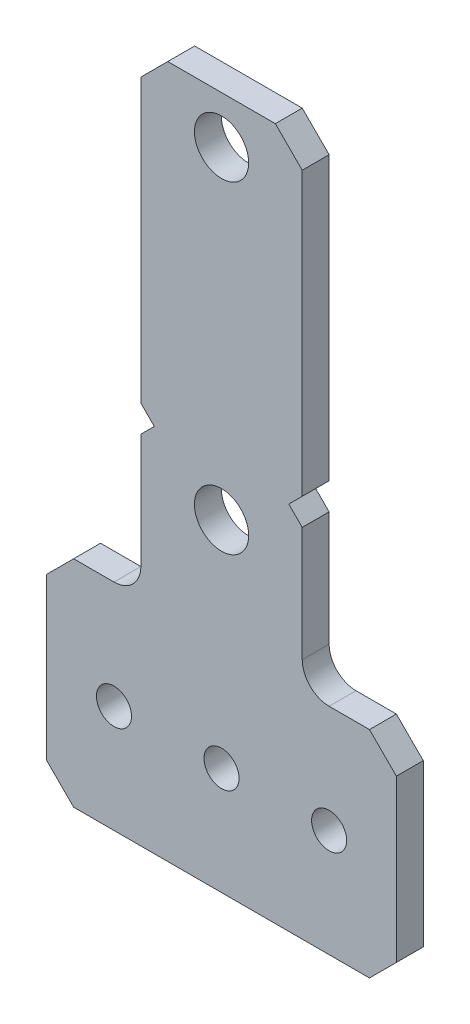
ISO-10303-21;
HEADER;
FILE_DESCRIPTION(('STEP AP214'),'2;1');
FILE_NAME('part.step','',(''),(''),'','','');
FILE_SCHEMA(('AUTOMOTIVE_DESIGN { 1 0 10303 214 1 1 1 1 }'));
ENDSEC;
DATA;
#1=APPLICATION_CONTEXT('core data for automotive mechanical design processes');
#2=APPLICATION_PROTOCOL_DEFINITION('international standard','automotive_design',2000,#1);
#3=PRODUCT_CONTEXT('',#1,'mechanical');
#4=PRODUCT('Part','Part','',(#3));
#5=PRODUCT_RELATED_PRODUCT_CATEGORY('part','',(#4));
#6=PRODUCT_DEFINITION_FORMATION('','',#4);
#7=PRODUCT_DEFINITION_CONTEXT('part definition',#1,'design');
#8=PRODUCT_DEFINITION('design','',#6,#7);
#9=PRODUCT_DEFINITION_SHAPE('','',#8);
#10=(LENGTH_UNIT() NAMED_UNIT(*) SI_UNIT(.MILLI.,.METRE.));
#11=(NAMED_UNIT(*) PLANE_ANGLE_UNIT() SI_UNIT($,.RADIAN.));
#12=(NAMED_UNIT(*) SI_UNIT($,.STERADIAN.) SOLID_ANGLE_UNIT());
#13=UNCERTAINTY_MEASURE_WITH_UNIT(LENGTH_MEASURE(1.E-05),#10,'distance_accuracy_value','');
#14=(GEOMETRIC_REPRESENTATION_CONTEXT(3) GLOBAL_UNCERTAINTY_ASSIGNED_CONTEXT((#13)) GLOBAL_UNIT_ASSIGNED_CONTEXT((#10,
#11,#12)) REPRESENTATION_CONTEXT('',''));
#15=CARTESIAN_POINT('',(0.,0.,0.));
#16=DIRECTION('',(0.,0.,1.));
#17=DIRECTION('',(1.,0.,0.));
#18=AXIS2_PLACEMENT_3D('',#15,#16,#17);
#19=CARTESIAN_POINT('',(-20.6375,-40.894,0.));
#20=DIRECTION('',(0.,0.,1.));
#21=DIRECTION('',(1.,0.,0.));
#22=AXIS2_PLACEMENT_3D('',#19,#20,#21);
#23=PLANE('',#22);
#24=DIRECTION('',(0.707106781186548,-0.707106781186548,0.));
#25=VECTOR('',#24,1.);
#26=CARTESIAN_POINT('',(17.4625,-15.494,0.));
#27=LINE('',#26,#25);
#28=CARTESIAN_POINT('',(17.4625,-15.494,0.));
#29=VERTEX_POINT('',#28);
#30=CARTESIAN_POINT('',(20.6375,-18.669,0.));
#31=VERTEX_POINT('',#30);
#32=EDGE_CURVE('E205',#29,#31,#27,.T.);
#33=ORIENTED_EDGE('',*,*,#32,.T.);
#34=DIRECTION('',(0.,1.,0.));
#35=VECTOR('',#34,1.);
#36=CARTESIAN_POINT('',(20.6375,40.894,0.));
#37=LINE('',#36,#35);
#38=CARTESIAN_POINT('',(20.6375,-37.719,0.));
#39=VERTEX_POINT('',#38);
#40=EDGE_CURVE('E222',#31,#39,#37,.F.);
#41=ORIENTED_EDGE('',*,*,#40,.T.);
#42=DIRECTION('',(-0.707106781186548,-0.707106781186547,0.));
#43=VECTOR('',#42,1.);
#44=CARTESIAN_POINT('',(20.6375,-37.719,0.));
#45=LINE('',#44,#43);
#46=CARTESIAN_POINT('',(17.4625,-40.894,0.));
#47=VERTEX_POINT('',#46);
#48=EDGE_CURVE('E216',#39,#47,#45,.T.);
#49=ORIENTED_EDGE('',*,*,#48,.T.);
#50=DIRECTION('',(1.,0.,0.));
#51=VECTOR('',#50,1.);
#52=CARTESIAN_POINT('',(-20.6375,-40.894,0.));
#53=LINE('',#52,#51);
#54=CARTESIAN_POINT('',(-17.4625,-40.894,0.));
#55=VERTEX_POINT('',#54);
#56=EDGE_CURVE('E217',#47,#55,#53,.F.);
#57=ORIENTED_EDGE('',*,*,#56,.T.);
#58=DIRECTION('',(-0.707106781186548,0.707106781186547,0.));
#59=VECTOR('',#58,1.);
#60=CARTESIAN_POINT('',(-17.4625,-40.894,0.));
#61=LINE('',#60,#59);
#62=CARTESIAN_POINT('',(-20.6375,-37.719,0.));
#63=VERTEX_POINT('',#62);
#64=EDGE_CURVE('E244',#55,#63,#61,.T.);
#65=ORIENTED_EDGE('',*,*,#64,.T.);
#66=DIRECTION('',(0.,1.,0.));
#67=VECTOR('',#66,1.);
#68=CARTESIAN_POINT('',(-20.6375,40.894,0.));
#69=LINE('',#68,#67);
#70=CARTESIAN_POINT('',(-20.6375,-18.669,0.));
#71=VERTEX_POINT('',#70);
#72=EDGE_CURVE('E241',#63,#71,#69,.T.);
#73=ORIENTED_EDGE('',*,*,#72,.T.);
#74=DIRECTION('',(0.707106781186547,0.707106781186548,0.));
#75=VECTOR('',#74,1.);
#76=CARTESIAN_POINT('',(-20.6375,-18.669,0.));
#77=LINE('',#76,#75);
#78=CARTESIAN_POINT('',(-17.4625,-15.494,0.));
#79=VERTEX_POINT('',#78);
#80=EDGE_CURVE('E233',#71,#79,#77,.T.);
#81=ORIENTED_EDGE('',*,*,#80,.T.);
#82=DIRECTION('',(1.,0.,0.));
#83=VECTOR('',#82,1.);
#84=CARTESIAN_POINT('',(-9.52499999999999,-15.494,0.));
#85=LINE('',#84,#83);
#86=CARTESIAN_POINT('',(-12.7,-15.494,0.));
#87=VERTEX_POINT('',#86);
#88=EDGE_CURVE('E230',#79,#87,#85,.T.);
#89=ORIENTED_EDGE('',*,*,#88,.T.);
#90=CARTESIAN_POINT('',(-12.7,-12.319,0.));
#91=DIRECTION('',(0.,0.,1.));
#92=DIRECTION('',(1.,0.,0.));
#93=AXIS2_PLACEMENT_3D('',#90,#91,#92);
#94=CIRCLE('',#93,3.175);
#95=CARTESIAN_POINT('',(-9.52499999999999,-12.319,0.));
#96=VERTEX_POINT('',#95);
#97=EDGE_CURVE('E254',#87,#96,#94,.T.);
#98=ORIENTED_EDGE('',*,*,#97,.T.);
#99=DIRECTION('',(0.,1.,0.));
#100=VECTOR('',#99,1.);
#101=CARTESIAN_POINT('',(-9.525,1.2065,0.));
#102=LINE('',#101,#100);
#103=CARTESIAN_POINT('',(-9.525,1.20650000000001,0.));
#104=VERTEX_POINT('',#103);
#105=EDGE_CURVE('E251',#96,#104,#102,.T.);
#106=ORIENTED_EDGE('',*,*,#105,.T.);
#107=DIRECTION('',(0.707106781186547,0.707106781186548,0.));
#108=VECTOR('',#107,1.);
#109=CARTESIAN_POINT('',(-9.525,1.2065,0.));
#110=LINE('',#109,#108);
#111=CARTESIAN_POINT('',(-7.93749999999999,2.794,0.));
#112=VERTEX_POINT('',#111);
#113=EDGE_CURVE('E258',#104,#112,#110,.T.);
#114=ORIENTED_EDGE('',*,*,#113,.T.);
#115=DIRECTION('',(-0.707106781186548,0.707106781186547,0.));
#116=VECTOR('',#115,1.);
#117=CARTESIAN_POINT('',(-7.93749999999999,2.79400000000001,0.));
#118=LINE('',#117,#116);
#119=CARTESIAN_POINT('',(-9.525,4.3815,0.));
#120=VERTEX_POINT('',#119);
#121=EDGE_CURVE('E264',#112,#120,#118,.T.);
#122=ORIENTED_EDGE('',*,*,#121,.T.);
#123=DIRECTION('',(0.,1.,0.));
#124=VECTOR('',#123,1.);
#125=CARTESIAN_POINT('',(-9.525,37.719,0.));
#126=LINE('',#125,#124);
#127=CARTESIAN_POINT('',(-9.525,37.719,0.));
#128=VERTEX_POINT('',#127);
#129=EDGE_CURVE('E269',#120,#128,#126,.T.);
#130=ORIENTED_EDGE('',*,*,#129,.T.);
#131=DIRECTION('',(0.707106781186549,0.707106781186546,0.));
#132=VECTOR('',#131,1.);
#133=CARTESIAN_POINT('',(-6.35,40.894,0.));
#134=LINE('',#133,#132);
#135=CARTESIAN_POINT('',(-6.35,40.894,0.));
#136=VERTEX_POINT('',#135);
#137=EDGE_CURVE('E274',#128,#136,#134,.T.);
#138=ORIENTED_EDGE('',*,*,#137,.T.);
#139=DIRECTION('',(1.,0.,0.));
#140=VECTOR('',#139,1.);
#141=CARTESIAN_POINT('',(-20.6375,40.894,0.));
#142=LINE('',#141,#140);
#143=CARTESIAN_POINT('',(6.34999999999999,40.894,0.));
#144=VERTEX_POINT('',#143);
#145=EDGE_CURVE('E279',#136,#144,#142,.T.);
#146=ORIENTED_EDGE('',*,*,#145,.T.);
#147=DIRECTION('',(0.707106781186548,-0.707106781186547,0.));
#148=VECTOR('',#147,1.);
#149=CARTESIAN_POINT('',(6.34999999999999,40.894,0.));
#150=LINE('',#149,#148);
#151=CARTESIAN_POINT('',(9.52499999999999,37.719,0.));
#152=VERTEX_POINT('',#151);
#153=EDGE_CURVE('E284',#144,#152,#150,.T.);
#154=ORIENTED_EDGE('',*,*,#153,.T.);
#155=DIRECTION('',(0.,-1.,0.));
#156=VECTOR('',#155,1.);
#157=CARTESIAN_POINT('',(9.52499999999999,37.719,0.));
#158=LINE('',#157,#156);
#159=CARTESIAN_POINT('',(9.52499999999999,4.3815,0.));
#160=VERTEX_POINT('',#159);
#161=EDGE_CURVE('E289',#152,#160,#158,.T.);
#162=ORIENTED_EDGE('',*,*,#161,.T.);
#163=DIRECTION('',(-0.707106781186548,-0.707106781186547,0.));
#164=VECTOR('',#163,1.);
#165=CARTESIAN_POINT('',(7.93749999999999,2.794,0.));
#166=LINE('',#165,#164);
#167=CARTESIAN_POINT('',(7.93749999999999,2.794,0.));
#168=VERTEX_POINT('',#167);
#169=EDGE_CURVE('E294',#160,#168,#166,.T.);
#170=ORIENTED_EDGE('',*,*,#169,.T.);
#171=DIRECTION('',(0.707106781186548,-0.707106781186547,0.));
#172=VECTOR('',#171,1.);
#173=CARTESIAN_POINT('',(9.52499999999999,1.2065,0.));
#174=LINE('',#173,#172);
#175=CARTESIAN_POINT('',(9.525,1.2065,0.));
#176=VERTEX_POINT('',#175);
#177=EDGE_CURVE('E299',#168,#176,#174,.T.);
#178=ORIENTED_EDGE('',*,*,#177,.T.);
#179=DIRECTION('',(0.,-1.,0.));
#180=VECTOR('',#179,1.);
#181=CARTESIAN_POINT('',(9.52499999999999,1.2065,0.));
#182=LINE('',#181,#180);
#183=CARTESIAN_POINT('',(9.525,-12.319,0.));
#184=VERTEX_POINT('',#183);
#185=EDGE_CURVE('E164',#176,#184,#182,.T.);
#186=ORIENTED_EDGE('',*,*,#185,.T.);
#187=CARTESIAN_POINT('',(12.7,-12.319,0.));
#188=DIRECTION('',(0.,0.,1.));
#189=DIRECTION('',(1.,0.,0.));
#190=AXIS2_PLACEMENT_3D('',#187,#188,#189);
#191=CIRCLE('',#190,3.175);
#192=CARTESIAN_POINT('',(12.7,-15.494,0.));
#193=VERTEX_POINT('',#192);
#194=EDGE_CURVE('E166',#184,#193,#191,.T.);
#195=ORIENTED_EDGE('',*,*,#194,.T.);
#196=DIRECTION('',(1.,0.,0.));
#197=VECTOR('',#196,1.);
#198=CARTESIAN_POINT('',(9.525,-15.494,0.));
#199=LINE('',#198,#197);
#200=EDGE_CURVE('E169',#193,#29,#199,.T.);
#201=ORIENTED_EDGE('',*,*,#200,.T.);
#202=EDGE_LOOP('',(#33,#41,#49,#57,#65,#73,#81,#89,#98,#106,#114,#122,#130,#138,#146,#154,#162,
#170,#178,#186,#195,#201));
#203=FACE_BOUND('',#202,.T.);
#204=CARTESIAN_POINT('',(0.,35.306,0.));
#205=DIRECTION('',(0.,0.,-1.));
#206=DIRECTION('',(-1.,0.,0.));
#207=AXIS2_PLACEMENT_3D('',#204,#205,#206);
#208=CIRCLE('',#207,3.2004);
#209=CARTESIAN_POINT('',(-3.2004,35.306,0.));
#210=VERTEX_POINT('',#209);
#211=EDGE_CURVE('E224',#210,#210,#208,.F.);
#212=ORIENTED_EDGE('',*,*,#211,.T.);
#213=EDGE_LOOP('',(#212));
#214=FACE_BOUND('',#213,.T.);
#215=CARTESIAN_POINT('',(0.,-2.79399999999999,0.));
#216=DIRECTION('',(0.,0.,-1.));
#217=DIRECTION('',(-1.,0.,0.));
#218=AXIS2_PLACEMENT_3D('',#215,#216,#217);
#219=CIRCLE('',#218,3.2004);
#220=CARTESIAN_POINT('',(-3.20039999999999,-2.79399999999999,0.));
#221=VERTEX_POINT('',#220);
#222=EDGE_CURVE('E335',#221,#221,#219,.F.);
#223=ORIENTED_EDGE('',*,*,#222,.T.);
#224=EDGE_LOOP('',(#223));
#225=FACE_BOUND('',#224,.T.);
#226=CARTESIAN_POINT('',(-12.7,-28.194,0.));
#227=DIRECTION('',(0.,0.,-1.));
#228=DIRECTION('',(-1.,0.,0.));
#229=AXIS2_PLACEMENT_3D('',#226,#227,#228);
#230=CIRCLE('',#229,2.0701);
#231=CARTESIAN_POINT('',(-14.7701,-28.194,0.));
#232=VERTEX_POINT('',#231);
#233=EDGE_CURVE('E338',#232,#232,#230,.F.);
#234=ORIENTED_EDGE('',*,*,#233,.T.);
#235=EDGE_LOOP('',(#234));
#236=FACE_BOUND('',#235,.T.);
#237=CARTESIAN_POINT('',(12.7,-28.194,0.));
#238=DIRECTION('',(0.,0.,-1.));
#239=DIRECTION('',(-1.,0.,0.));
#240=AXIS2_PLACEMENT_3D('',#237,#238,#239);
#241=CIRCLE('',#240,2.0701);
#242=CARTESIAN_POINT('',(10.6299,-28.194,0.));
#243=VERTEX_POINT('',#242);
#244=EDGE_CURVE('E340',#243,#243,#241,.F.);
#245=ORIENTED_EDGE('',*,*,#244,.T.);
#246=EDGE_LOOP('',(#245));
#247=FACE_BOUND('',#246,.T.);
#248=CARTESIAN_POINT('',(0.,-28.194,0.));
#249=DIRECTION('',(0.,0.,-1.));
#250=DIRECTION('',(-1.,0.,0.));
#251=AXIS2_PLACEMENT_3D('',#248,#249,#250);
#252=CIRCLE('',#251,2.0701);
#253=CARTESIAN_POINT('',(-2.07009999999999,-28.194,0.));
#254=VERTEX_POINT('',#253);
#255=EDGE_CURVE('E20',#254,#254,#252,.F.);
#256=ORIENTED_EDGE('',*,*,#255,.T.);
#257=EDGE_LOOP('',(#256));
#258=FACE_BOUND('',#257,.T.);
#259=ADVANCED_FACE('F17',(#203,#214,#225,#236,#247,#258),#23,.F.);
#260=CARTESIAN_POINT('',(0.,-28.194,3.175));
#261=DIRECTION('',(0.,0.,-1.));
#262=DIRECTION('',(-1.,0.,0.));
#263=AXIS2_PLACEMENT_3D('',#260,#261,#262);
#264=CYLINDRICAL_SURFACE('',#263,2.0701);
#265=CARTESIAN_POINT('',(0.,-28.194,3.175));
#266=DIRECTION('',(0.,0.,-1.));
#267=DIRECTION('',(-1.,0.,0.));
#268=AXIS2_PLACEMENT_3D('',#265,#266,#267);
#269=CIRCLE('',#268,2.0701);
#270=CARTESIAN_POINT('',(-2.07009999999999,-28.194,3.175));
#271=VERTEX_POINT('',#270);
#272=EDGE_CURVE('E328',#271,#271,#269,.T.);
#273=ORIENTED_EDGE('',*,*,#272,.F.);
#274=EDGE_LOOP('',(#273));
#275=FACE_BOUND('',#274,.T.);
#276=ORIENTED_EDGE('',*,*,#255,.F.);
#277=EDGE_LOOP('',(#276));
#278=FACE_BOUND('',#277,.T.);
#279=ADVANCED_FACE('F348',(#275,#278),#264,.F.);
#280=CARTESIAN_POINT('',(12.7,-28.194,3.175));
#281=DIRECTION('',(0.,0.,-1.));
#282=DIRECTION('',(-1.,0.,0.));
#283=AXIS2_PLACEMENT_3D('',#280,#281,#282);
#284=CYLINDRICAL_SURFACE('',#283,2.0701);
#285=CARTESIAN_POINT('',(12.7,-28.194,3.175));
#286=DIRECTION('',(0.,0.,-1.));
#287=DIRECTION('',(-1.,0.,0.));
#288=AXIS2_PLACEMENT_3D('',#285,#286,#287);
#289=CIRCLE('',#288,2.0701);
#290=CARTESIAN_POINT('',(10.6299,-28.194,3.175));
#291=VERTEX_POINT('',#290);
#292=EDGE_CURVE('E325',#291,#291,#289,.T.);
#293=ORIENTED_EDGE('',*,*,#292,.F.);
#294=EDGE_LOOP('',(#293));
#295=FACE_BOUND('',#294,.T.);
#296=ORIENTED_EDGE('',*,*,#244,.F.);
#297=EDGE_LOOP('',(#296));
#298=FACE_BOUND('',#297,.T.);
#299=ADVANCED_FACE('F350',(#295,#298),#284,.F.);
#300=CARTESIAN_POINT('',(-12.7,-28.194,3.175));
#301=DIRECTION('',(0.,0.,-1.));
#302=DIRECTION('',(-1.,0.,0.));
#303=AXIS2_PLACEMENT_3D('',#300,#301,#302);
#304=CYLINDRICAL_SURFACE('',#303,2.0701);
#305=CARTESIAN_POINT('',(-12.7,-28.194,3.175));
#306=DIRECTION('',(0.,0.,-1.));
#307=DIRECTION('',(-1.,0.,0.));
#308=AXIS2_PLACEMENT_3D('',#305,#306,#307);
#309=CIRCLE('',#308,2.0701);
#310=CARTESIAN_POINT('',(-14.7701,-28.194,3.175));
#311=VERTEX_POINT('',#310);
#312=EDGE_CURVE('E322',#311,#311,#309,.T.);
#313=ORIENTED_EDGE('',*,*,#312,.F.);
#314=EDGE_LOOP('',(#313));
#315=FACE_BOUND('',#314,.T.);
#316=ORIENTED_EDGE('',*,*,#233,.F.);
#317=EDGE_LOOP('',(#316));
#318=FACE_BOUND('',#317,.T.);
#319=ADVANCED_FACE('F357',(#315,#318),#304,.F.);
#320=CARTESIAN_POINT('',(0.,-2.79399999999999,3.175));
#321=DIRECTION('',(0.,0.,-1.));
#322=DIRECTION('',(-1.,0.,0.));
#323=AXIS2_PLACEMENT_3D('',#320,#321,#322);
#324=CYLINDRICAL_SURFACE('',#323,3.2004);
#325=CARTESIAN_POINT('',(0.,-2.79399999999999,3.175));
#326=DIRECTION('',(0.,0.,-1.));
#327=DIRECTION('',(-1.,0.,0.));
#328=AXIS2_PLACEMENT_3D('',#325,#326,#327);
#329=CIRCLE('',#328,3.2004);
#330=CARTESIAN_POINT('',(-3.20039999999999,-2.79399999999999,3.175));
#331=VERTEX_POINT('',#330);
#332=EDGE_CURVE('E319',#331,#331,#329,.T.);
#333=ORIENTED_EDGE('',*,*,#332,.F.);
#334=EDGE_LOOP('',(#333));
#335=FACE_BOUND('',#334,.T.);
#336=ORIENTED_EDGE('',*,*,#222,.F.);
#337=EDGE_LOOP('',(#336));
#338=FACE_BOUND('',#337,.T.);
#339=ADVANCED_FACE('F456',(#335,#338),#324,.F.);
#340=CARTESIAN_POINT('',(0.,35.306,3.175));
#341=DIRECTION('',(0.,0.,-1.));
#342=DIRECTION('',(-1.,0.,0.));
#343=AXIS2_PLACEMENT_3D('',#340,#341,#342);
#344=CYLINDRICAL_SURFACE('',#343,3.2004);
#345=CARTESIAN_POINT('',(0.,35.306,3.175));
#346=DIRECTION('',(0.,0.,-1.));
#347=DIRECTION('',(-1.,0.,0.));
#348=AXIS2_PLACEMENT_3D('',#345,#346,#347);
#349=CIRCLE('',#348,3.2004);
#350=CARTESIAN_POINT('',(-3.2004,35.306,3.175));
#351=VERTEX_POINT('',#350);
#352=EDGE_CURVE('E210',#351,#351,#349,.T.);
#353=ORIENTED_EDGE('',*,*,#352,.F.);
#354=EDGE_LOOP('',(#353));
#355=FACE_BOUND('',#354,.T.);
#356=ORIENTED_EDGE('',*,*,#211,.F.);
#357=EDGE_LOOP('',(#356));
#358=FACE_BOUND('',#357,.T.);
#359=ADVANCED_FACE('F452',(#355,#358),#344,.F.);
#360=CARTESIAN_POINT('',(20.6375,40.894,3.175));
#361=DIRECTION('',(-1.,0.,0.));
#362=DIRECTION('',(0.,0.,1.));
#363=AXIS2_PLACEMENT_3D('',#360,#361,#362);
#364=PLANE('',#363);
#365=DIRECTION('',(0.,0.,1.));
#366=VECTOR('',#365,1.);
#367=CARTESIAN_POINT('',(20.6375,-18.669,3.175));
#368=LINE('',#367,#366);
#369=CARTESIAN_POINT('',(20.6375,-18.669,3.175));
#370=VERTEX_POINT('',#369);
#371=EDGE_CURVE('E182',#31,#370,#368,.T.);
#372=ORIENTED_EDGE('',*,*,#371,.T.);
#373=DIRECTION('',(0.,1.,0.));
#374=VECTOR('',#373,1.);
#375=CARTESIAN_POINT('',(20.6375,-40.894,3.175));
#376=LINE('',#375,#374);
#377=CARTESIAN_POINT('',(20.6375,-37.719,3.175));
#378=VERTEX_POINT('',#377);
#379=EDGE_CURVE('E201',#378,#370,#376,.T.);
#380=ORIENTED_EDGE('',*,*,#379,.F.);
#381=DIRECTION('',(0.,0.,1.));
#382=VECTOR('',#381,1.);
#383=CARTESIAN_POINT('',(20.6375,-37.719,3.175));
#384=LINE('',#383,#382);
#385=EDGE_CURVE('E213',#378,#39,#384,.F.);
#386=ORIENTED_EDGE('',*,*,#385,.T.);
#387=ORIENTED_EDGE('',*,*,#40,.F.);
#388=EDGE_LOOP('',(#372,#380,#386,#387));
#389=FACE_BOUND('',#388,.T.);
#390=ADVANCED_FACE('F448',(#389),#364,.F.);
#391=CARTESIAN_POINT('',(17.4625,-15.494,3.175));
#392=DIRECTION('',(-0.707106781186548,-0.707106781186548,0.));
#393=DIRECTION('',(0.707106781186548,-0.707106781186548,0.));
#394=AXIS2_PLACEMENT_3D('',#391,#392,#393);
#395=PLANE('',#394);
#396=ORIENTED_EDGE('',*,*,#371,.F.);
#397=ORIENTED_EDGE('',*,*,#32,.F.);
#398=DIRECTION('',(0.,0.,1.));
#399=VECTOR('',#398,1.);
#400=CARTESIAN_POINT('',(17.4625,-15.494,3.175));
#401=LINE('',#400,#399);
#402=CARTESIAN_POINT('',(17.4625,-15.494,3.175));
#403=VERTEX_POINT('',#402);
#404=EDGE_CURVE('E175',#29,#403,#401,.T.);
#405=ORIENTED_EDGE('',*,*,#404,.T.);
#406=DIRECTION('',(-0.707106781186548,0.707106781186547,0.));
#407=VECTOR('',#406,1.);
#408=CARTESIAN_POINT('',(20.6375,-18.669,3.175));
#409=LINE('',#408,#407);
#410=EDGE_CURVE('E197',#370,#403,#409,.T.);
#411=ORIENTED_EDGE('',*,*,#410,.F.);
#412=EDGE_LOOP('',(#396,#397,#405,#411));
#413=FACE_BOUND('',#412,.T.);
#414=ADVANCED_FACE('F445',(#413),#395,.F.);
#415=CARTESIAN_POINT('',(9.525,-15.494,3.175));
#416=DIRECTION('',(0.,-1.,0.));
#417=DIRECTION('',(1.,0.,0.));
#418=AXIS2_PLACEMENT_3D('',#415,#416,#417);
#419=PLANE('',#418);
#420=ORIENTED_EDGE('',*,*,#404,.F.);
#421=ORIENTED_EDGE('',*,*,#200,.F.);
#422=DIRECTION('',(0.,0.,1.));
#423=VECTOR('',#422,1.);
#424=CARTESIAN_POINT('',(12.7,-15.494,3.175));
#425=LINE('',#424,#423);
#426=CARTESIAN_POINT('',(12.7,-15.494,3.175));
#427=VERTEX_POINT('',#426);
#428=EDGE_CURVE('E174',#193,#427,#425,.T.);
#429=ORIENTED_EDGE('',*,*,#428,.T.);
#430=DIRECTION('',(1.,0.,0.));
#431=VECTOR('',#430,1.);
#432=CARTESIAN_POINT('',(-20.6375,-15.494,3.175));
#433=LINE('',#432,#431);
#434=EDGE_CURVE('E200',#403,#427,#433,.F.);
#435=ORIENTED_EDGE('',*,*,#434,.F.);
#436=EDGE_LOOP('',(#420,#421,#429,#435));
#437=FACE_BOUND('',#436,.T.);
#438=ADVANCED_FACE('F179',(#437),#419,.F.);
#439=CARTESIAN_POINT('',(12.7,-12.319,3.175));
#440=DIRECTION('',(0.,0.,1.));
#441=DIRECTION('',(1.,0.,0.));
#442=AXIS2_PLACEMENT_3D('',#439,#440,#441);
#443=CYLINDRICAL_SURFACE('',#442,3.175);
#444=ORIENTED_EDGE('',*,*,#428,.F.);
#445=ORIENTED_EDGE('',*,*,#194,.F.);
#446=DIRECTION('',(0.,0.,1.));
#447=VECTOR('',#446,1.);
#448=CARTESIAN_POINT('',(9.525,-12.319,3.175));
#449=LINE('',#448,#447);
#450=CARTESIAN_POINT('',(9.525,-12.319,3.175));
#451=VERTEX_POINT('',#450);
#452=EDGE_CURVE('E189',#184,#451,#449,.T.);
#453=ORIENTED_EDGE('',*,*,#452,.T.);
#454=CARTESIAN_POINT('',(12.7,-12.319,3.175));
#455=DIRECTION('',(0.,0.,1.));
#456=DIRECTION('',(1.,0.,0.));
#457=AXIS2_PLACEMENT_3D('',#454,#455,#456);
#458=CIRCLE('',#457,3.175);
#459=EDGE_CURVE('E186',#427,#451,#458,.F.);
#460=ORIENTED_EDGE('',*,*,#459,.F.);
#461=EDGE_LOOP('',(#444,#445,#453,#460));
#462=FACE_BOUND('',#461,.T.);
#463=ADVANCED_FACE('F184',(#462),#443,.F.);
#464=CARTESIAN_POINT('',(9.52499999999999,1.2065,3.175));
#465=DIRECTION('',(-1.,0.,0.));
#466=DIRECTION('',(0.,-1.,0.));
#467=AXIS2_PLACEMENT_3D('',#464,#465,#466);
#468=PLANE('',#467);
#469=ORIENTED_EDGE('',*,*,#452,.F.);
#470=ORIENTED_EDGE('',*,*,#185,.F.);
#471=DIRECTION('',(0.,0.,1.));
#472=VECTOR('',#471,1.);
#473=CARTESIAN_POINT('',(9.525,1.2065,3.175));
#474=LINE('',#473,#472);
#475=CARTESIAN_POINT('',(9.52499999999999,1.2065,3.175));
#476=VERTEX_POINT('',#475);
#477=EDGE_CURVE('E296',#176,#476,#474,.T.);
#478=ORIENTED_EDGE('',*,*,#477,.T.);
#479=DIRECTION('',(0.,1.,0.));
#480=VECTOR('',#479,1.);
#481=CARTESIAN_POINT('',(9.525,-40.894,3.175));
#482=LINE('',#481,#480);
#483=EDGE_CURVE('E316',#451,#476,#482,.T.);
#484=ORIENTED_EDGE('',*,*,#483,.F.);
#485=EDGE_LOOP('',(#469,#470,#478,#484));
#486=FACE_BOUND('',#485,.T.);
#487=ADVANCED_FACE('F436',(#486),#468,.F.);
#488=CARTESIAN_POINT('',(9.52499999999999,1.2065,3.175));
#489=DIRECTION('',(-0.707106781186547,-0.707106781186548,0.));
#490=DIRECTION('',(0.707106781186548,-0.707106781186547,0.));
#491=AXIS2_PLACEMENT_3D('',#488,#489,#490);
#492=PLANE('',#491);
#493=DIRECTION('',(-0.707106781186549,0.707106781186546,0.));
#494=VECTOR('',#493,1.);
#495=CARTESIAN_POINT('',(9.525,1.2065,3.175));
#496=LINE('',#495,#494);
#497=CARTESIAN_POINT('',(7.93749999999999,2.794,3.175));
#498=VERTEX_POINT('',#497);
#499=EDGE_CURVE('E747',#476,#498,#496,.T.);
#500=ORIENTED_EDGE('',*,*,#499,.F.);
#501=ORIENTED_EDGE('',*,*,#477,.F.);
#502=ORIENTED_EDGE('',*,*,#177,.F.);
#503=DIRECTION('',(0.,0.,1.));
#504=VECTOR('',#503,1.);
#505=CARTESIAN_POINT('',(7.93749999999999,2.794,3.175));
#506=LINE('',#505,#504);
#507=EDGE_CURVE('E291',#168,#498,#506,.T.);
#508=ORIENTED_EDGE('',*,*,#507,.T.);
#509=EDGE_LOOP('',(#500,#501,#502,#508));
#510=FACE_BOUND('',#509,.T.);
#511=ADVANCED_FACE('F432',(#510),#492,.F.);
#512=CARTESIAN_POINT('',(7.93749999999999,2.794,3.175));
#513=DIRECTION('',(-0.707106781186547,0.707106781186548,0.));
#514=DIRECTION('',(-0.707106781186548,-0.707106781186547,0.));
#515=AXIS2_PLACEMENT_3D('',#512,#513,#514);
#516=PLANE('',#515);
#517=DIRECTION('',(0.707106781186548,0.707106781186548,0.));
#518=VECTOR('',#517,1.);
#519=CARTESIAN_POINT('',(7.93749999999999,2.794,3.175));
#520=LINE('',#519,#518);
#521=CARTESIAN_POINT('',(9.525,4.3815,3.175));
#522=VERTEX_POINT('',#521);
#523=EDGE_CURVE('E739',#498,#522,#520,.T.);
#524=ORIENTED_EDGE('',*,*,#523,.F.);
#525=ORIENTED_EDGE('',*,*,#507,.F.);
#526=ORIENTED_EDGE('',*,*,#169,.F.);
#527=DIRECTION('',(0.,0.,1.));
#528=VECTOR('',#527,1.);
#529=CARTESIAN_POINT('',(9.52499999999999,4.3815,3.175));
#530=LINE('',#529,#528);
#531=EDGE_CURVE('E286',#160,#522,#530,.T.);
#532=ORIENTED_EDGE('',*,*,#531,.T.);
#533=EDGE_LOOP('',(#524,#525,#526,#532));
#534=FACE_BOUND('',#533,.T.);
#535=ADVANCED_FACE('F428',(#534),#516,.F.);
#536=CARTESIAN_POINT('',(9.52499999999999,37.719,3.175));
#537=DIRECTION('',(-1.,0.,0.));
#538=DIRECTION('',(0.,-1.,0.));
#539=AXIS2_PLACEMENT_3D('',#536,#537,#538);
#540=PLANE('',#539);
#541=DIRECTION('',(0.,1.,0.));
#542=VECTOR('',#541,1.);
#543=CARTESIAN_POINT('',(9.525,-40.894,3.175));
#544=LINE('',#543,#542);
#545=CARTESIAN_POINT('',(9.52499999999999,37.719,3.175));
#546=VERTEX_POINT('',#545);
#547=EDGE_CURVE('E731',#522,#546,#544,.T.);
#548=ORIENTED_EDGE('',*,*,#547,.F.);
#549=ORIENTED_EDGE('',*,*,#531,.F.);
#550=ORIENTED_EDGE('',*,*,#161,.F.);
#551=DIRECTION('',(0.,0.,1.));
#552=VECTOR('',#551,1.);
#553=CARTESIAN_POINT('',(9.52499999999999,37.719,3.175));
#554=LINE('',#553,#552);
#555=EDGE_CURVE('E281',#152,#546,#554,.T.);
#556=ORIENTED_EDGE('',*,*,#555,.T.);
#557=EDGE_LOOP('',(#548,#549,#550,#556));
#558=FACE_BOUND('',#557,.T.);
#559=ADVANCED_FACE('F424',(#558),#540,.F.);
#560=CARTESIAN_POINT('',(6.34999999999999,40.894,3.175));
#561=DIRECTION('',(-0.707106781186547,-0.707106781186548,0.));
#562=DIRECTION('',(0.707106781186548,-0.707106781186547,0.));
#563=AXIS2_PLACEMENT_3D('',#560,#561,#562);
#564=PLANE('',#563);
#565=ORIENTED_EDGE('',*,*,#555,.F.);
#566=ORIENTED_EDGE('',*,*,#153,.F.);
#567=DIRECTION('',(0.,0.,-1.));
#568=VECTOR('',#567,1.);
#569=CARTESIAN_POINT('',(6.34999999999998,40.894,3.175));
#570=LINE('',#569,#568);
#571=CARTESIAN_POINT('',(6.34999999999998,40.894,3.175));
#572=VERTEX_POINT('',#571);
#573=EDGE_CURVE('E276',#144,#572,#570,.F.);
#574=ORIENTED_EDGE('',*,*,#573,.T.);
#575=DIRECTION('',(-0.707106781186548,0.707106781186547,0.));
#576=VECTOR('',#575,1.);
#577=CARTESIAN_POINT('',(9.52499999999999,37.719,3.175));
#578=LINE('',#577,#576);
#579=EDGE_CURVE('E723',#546,#572,#578,.T.);
#580=ORIENTED_EDGE('',*,*,#579,.F.);
#581=EDGE_LOOP('',(#565,#566,#574,#580));
#582=FACE_BOUND('',#581,.T.);
#583=ADVANCED_FACE('F420',(#582),#564,.F.);
#584=CARTESIAN_POINT('',(-20.6375,40.894,3.175));
#585=DIRECTION('',(0.,-1.,0.));
#586=DIRECTION('',(0.,0.,-1.));
#587=AXIS2_PLACEMENT_3D('',#584,#585,#586);
#588=PLANE('',#587);
#589=DIRECTION('',(1.,0.,0.));
#590=VECTOR('',#589,1.);
#591=CARTESIAN_POINT('',(-20.6375,40.894,3.175));
#592=LINE('',#591,#590);
#593=CARTESIAN_POINT('',(-6.34999999999999,40.894,3.175));
#594=VERTEX_POINT('',#593);
#595=EDGE_CURVE('E715',#572,#594,#592,.F.);
#596=ORIENTED_EDGE('',*,*,#595,.F.);
#597=ORIENTED_EDGE('',*,*,#573,.F.);
#598=ORIENTED_EDGE('',*,*,#145,.F.);
#599=DIRECTION('',(0.,0.,1.));
#600=VECTOR('',#599,1.);
#601=CARTESIAN_POINT('',(-6.35,40.894,3.175));
#602=LINE('',#601,#600);
#603=EDGE_CURVE('E271',#136,#594,#602,.T.);
#604=ORIENTED_EDGE('',*,*,#603,.T.);
#605=EDGE_LOOP('',(#596,#597,#598,#604));
#606=FACE_BOUND('',#605,.T.);
#607=ADVANCED_FACE('F416',(#606),#588,.F.);
#608=CARTESIAN_POINT('',(-6.35,40.894,3.175));
#609=DIRECTION('',(0.707106781186546,-0.707106781186549,0.));
#610=DIRECTION('',(0.707106781186549,0.707106781186546,0.));
#611=AXIS2_PLACEMENT_3D('',#608,#609,#610);
#612=PLANE('',#611);
#613=DIRECTION('',(-0.707106781186548,-0.707106781186547,0.));
#614=VECTOR('',#613,1.);
#615=CARTESIAN_POINT('',(-6.35,40.894,3.175));
#616=LINE('',#615,#614);
#617=CARTESIAN_POINT('',(-9.525,37.719,3.175));
#618=VERTEX_POINT('',#617);
#619=EDGE_CURVE('E707',#594,#618,#616,.T.);
#620=ORIENTED_EDGE('',*,*,#619,.F.);
#621=ORIENTED_EDGE('',*,*,#603,.F.);
#622=ORIENTED_EDGE('',*,*,#137,.F.);
#623=DIRECTION('',(0.,0.,1.));
#624=VECTOR('',#623,1.);
#625=CARTESIAN_POINT('',(-9.525,37.719,3.175));
#626=LINE('',#625,#624);
#627=EDGE_CURVE('E266',#128,#618,#626,.T.);
#628=ORIENTED_EDGE('',*,*,#627,.T.);
#629=EDGE_LOOP('',(#620,#621,#622,#628));
#630=FACE_BOUND('',#629,.T.);
#631=ADVANCED_FACE('F412',(#630),#612,.F.);
#632=CARTESIAN_POINT('',(-9.525,37.719,3.175));
#633=DIRECTION('',(1.,0.,0.));
#634=DIRECTION('',(0.,1.,0.));
#635=AXIS2_PLACEMENT_3D('',#632,#633,#634);
#636=PLANE('',#635);
#637=DIRECTION('',(0.,1.,0.));
#638=VECTOR('',#637,1.);
#639=CARTESIAN_POINT('',(-9.525,-40.894,3.175));
#640=LINE('',#639,#638);
#641=CARTESIAN_POINT('',(-9.525,4.38150000000002,3.175));
#642=VERTEX_POINT('',#641);
#643=EDGE_CURVE('E699',#618,#642,#640,.F.);
#644=ORIENTED_EDGE('',*,*,#643,.F.);
#645=ORIENTED_EDGE('',*,*,#627,.F.);
#646=ORIENTED_EDGE('',*,*,#129,.F.);
#647=DIRECTION('',(0.,0.,1.));
#648=VECTOR('',#647,1.);
#649=CARTESIAN_POINT('',(-9.525,4.3815,3.175));
#650=LINE('',#649,#648);
#651=EDGE_CURVE('E261',#120,#642,#650,.T.);
#652=ORIENTED_EDGE('',*,*,#651,.T.);
#653=EDGE_LOOP('',(#644,#645,#646,#652));
#654=FACE_BOUND('',#653,.T.);
#655=ADVANCED_FACE('F408',(#654),#636,.F.);
#656=CARTESIAN_POINT('',(-7.93749999999999,2.79400000000001,3.175));
#657=DIRECTION('',(0.707106781186547,0.707106781186548,0.));
#658=DIRECTION('',(-0.707106781186548,0.707106781186547,0.));
#659=AXIS2_PLACEMENT_3D('',#656,#657,#658);
#660=PLANE('',#659);
#661=DIRECTION('',(0.707106781186548,-0.707106781186547,0.));
#662=VECTOR('',#661,1.);
#663=CARTESIAN_POINT('',(-9.525,4.3815,3.175));
#664=LINE('',#663,#662);
#665=CARTESIAN_POINT('',(-7.93749999999999,2.794,3.175));
#666=VERTEX_POINT('',#665);
#667=EDGE_CURVE('E691',#642,#666,#664,.T.);
#668=ORIENTED_EDGE('',*,*,#667,.F.);
#669=ORIENTED_EDGE('',*,*,#651,.F.);
#670=ORIENTED_EDGE('',*,*,#121,.F.);
#671=DIRECTION('',(0.,0.,1.));
#672=VECTOR('',#671,1.);
#673=CARTESIAN_POINT('',(-7.93749999999999,2.794,3.175));
#674=LINE('',#673,#672);
#675=EDGE_CURVE('E260',#112,#666,#674,.T.);
#676=ORIENTED_EDGE('',*,*,#675,.T.);
#677=EDGE_LOOP('',(#668,#669,#670,#676));
#678=FACE_BOUND('',#677,.T.);
#679=ADVANCED_FACE('F404',(#678),#660,.F.);
#680=CARTESIAN_POINT('',(-9.525,1.2065,3.175));
#681=DIRECTION('',(0.707106781186548,-0.707106781186547,0.));
#682=DIRECTION('',(0.707106781186547,0.707106781186548,0.));
#683=AXIS2_PLACEMENT_3D('',#680,#681,#682);
#684=PLANE('',#683);
#685=DIRECTION('',(-0.707106781186548,-0.707106781186547,0.));
#686=VECTOR('',#685,1.);
#687=CARTESIAN_POINT('',(-7.93749999999999,2.794,3.175));
#688=LINE('',#687,#686);
#689=CARTESIAN_POINT('',(-9.525,1.20650000000001,3.175));
#690=VERTEX_POINT('',#689);
#691=EDGE_CURVE('E688',#666,#690,#688,.T.);
#692=ORIENTED_EDGE('',*,*,#691,.F.);
#693=ORIENTED_EDGE('',*,*,#675,.F.);
#694=ORIENTED_EDGE('',*,*,#113,.F.);
#695=DIRECTION('',(0.,0.,1.));
#696=VECTOR('',#695,1.);
#697=CARTESIAN_POINT('',(-9.525,1.20650000000001,3.175));
#698=LINE('',#697,#696);
#699=EDGE_CURVE('E255',#104,#690,#698,.T.);
#700=ORIENTED_EDGE('',*,*,#699,.T.);
#701=EDGE_LOOP('',(#692,#693,#694,#700));
#702=FACE_BOUND('',#701,.T.);
#703=ADVANCED_FACE('F400',(#702),#684,.F.);
#704=CARTESIAN_POINT('',(-9.525,1.2065,3.175));
#705=DIRECTION('',(1.,0.,0.));
#706=DIRECTION('',(0.,1.,0.));
#707=AXIS2_PLACEMENT_3D('',#704,#705,#706);
#708=PLANE('',#707);
#709=DIRECTION('',(0.,0.,1.));
#710=VECTOR('',#709,1.);
#711=CARTESIAN_POINT('',(-9.52499999999999,-12.319,3.175));
#712=LINE('',#711,#710);
#713=CARTESIAN_POINT('',(-9.52499999999999,-12.319,3.175));
#714=VERTEX_POINT('',#713);
#715=EDGE_CURVE('E331',#96,#714,#712,.T.);
#716=ORIENTED_EDGE('',*,*,#715,.T.);
#717=DIRECTION('',(0.,1.,0.));
#718=VECTOR('',#717,1.);
#719=CARTESIAN_POINT('',(-9.525,-40.894,3.175));
#720=LINE('',#719,#718);
#721=EDGE_CURVE('E314',#690,#714,#720,.F.);
#722=ORIENTED_EDGE('',*,*,#721,.F.);
#723=ORIENTED_EDGE('',*,*,#699,.F.);
#724=ORIENTED_EDGE('',*,*,#105,.F.);
#725=EDGE_LOOP('',(#716,#722,#723,#724));
#726=FACE_BOUND('',#725,.T.);
#727=ADVANCED_FACE('F396',(#726),#708,.F.);
#728=CARTESIAN_POINT('',(-12.7,-12.319,3.175));
#729=DIRECTION('',(0.,0.,1.));
#730=DIRECTION('',(1.,0.,0.));
#731=AXIS2_PLACEMENT_3D('',#728,#729,#730);
#732=CYLINDRICAL_SURFACE('',#731,3.175);
#733=ORIENTED_EDGE('',*,*,#715,.F.);
#734=ORIENTED_EDGE('',*,*,#97,.F.);
#735=DIRECTION('',(0.,0.,1.));
#736=VECTOR('',#735,1.);
#737=CARTESIAN_POINT('',(-12.7,-15.494,3.175));
#738=LINE('',#737,#736);
#739=CARTESIAN_POINT('',(-12.7,-15.494,3.175));
#740=VERTEX_POINT('',#739);
#741=EDGE_CURVE('E234',#87,#740,#738,.T.);
#742=ORIENTED_EDGE('',*,*,#741,.T.);
#743=CARTESIAN_POINT('',(-12.7,-12.319,3.175));
#744=DIRECTION('',(0.,0.,1.));
#745=DIRECTION('',(1.,0.,0.));
#746=AXIS2_PLACEMENT_3D('',#743,#744,#745);
#747=CIRCLE('',#746,3.175);
#748=EDGE_CURVE('E310',#714,#740,#747,.F.);
#749=ORIENTED_EDGE('',*,*,#748,.F.);
#750=EDGE_LOOP('',(#733,#734,#742,#749));
#751=FACE_BOUND('',#750,.T.);
#752=ADVANCED_FACE('F392',(#751),#732,.F.);
#753=CARTESIAN_POINT('',(-9.52499999999999,-15.494,3.175));
#754=DIRECTION('',(0.,-1.,0.));
#755=DIRECTION('',(1.,0.,0.));
#756=AXIS2_PLACEMENT_3D('',#753,#754,#755);
#757=PLANE('',#756);
#758=DIRECTION('',(0.,0.,1.));
#759=VECTOR('',#758,1.);
#760=CARTESIAN_POINT('',(-17.4625,-15.494,3.175));
#761=LINE('',#760,#759);
#762=CARTESIAN_POINT('',(-17.4625,-15.494,3.175));
#763=VERTEX_POINT('',#762);
#764=EDGE_CURVE('E238',#79,#763,#761,.T.);
#765=ORIENTED_EDGE('',*,*,#764,.T.);
#766=DIRECTION('',(1.,0.,0.));
#767=VECTOR('',#766,1.);
#768=CARTESIAN_POINT('',(-20.6375,-15.494,3.175));
#769=LINE('',#768,#767);
#770=EDGE_CURVE('E313',#740,#763,#769,.F.);
#771=ORIENTED_EDGE('',*,*,#770,.F.);
#772=ORIENTED_EDGE('',*,*,#741,.F.);
#773=ORIENTED_EDGE('',*,*,#88,.F.);
#774=EDGE_LOOP('',(#765,#771,#772,#773));
#775=FACE_BOUND('',#774,.T.);
#776=ADVANCED_FACE('F388',(#775),#757,.F.);
#777=CARTESIAN_POINT('',(-20.6375,-18.669,3.175));
#778=DIRECTION('',(0.707106781186548,-0.707106781186547,0.));
#779=DIRECTION('',(0.707106781186547,0.707106781186548,0.));
#780=AXIS2_PLACEMENT_3D('',#777,#778,#779);
#781=PLANE('',#780);
#782=ORIENTED_EDGE('',*,*,#764,.F.);
#783=ORIENTED_EDGE('',*,*,#80,.F.);
#784=DIRECTION('',(0.,0.,-1.));
#785=VECTOR('',#784,1.);
#786=CARTESIAN_POINT('',(-20.6375,-18.669,3.175));
#787=LINE('',#786,#785);
#788=CARTESIAN_POINT('',(-20.6375,-18.669,3.175));
#789=VERTEX_POINT('',#788);
#790=EDGE_CURVE('E245',#71,#789,#787,.F.);
#791=ORIENTED_EDGE('',*,*,#790,.T.);
#792=DIRECTION('',(-0.707106781186548,-0.707106781186548,0.));
#793=VECTOR('',#792,1.);
#794=CARTESIAN_POINT('',(-17.4625,-15.494,3.175));
#795=LINE('',#794,#793);
#796=EDGE_CURVE('E675',#763,#789,#795,.T.);
#797=ORIENTED_EDGE('',*,*,#796,.F.);
#798=EDGE_LOOP('',(#782,#783,#791,#797));
#799=FACE_BOUND('',#798,.T.);
#800=ADVANCED_FACE('F384',(#799),#781,.F.);
#801=CARTESIAN_POINT('',(-20.6375,40.894,3.175));
#802=DIRECTION('',(1.,0.,0.));
#803=DIRECTION('',(0.,0.,-1.));
#804=AXIS2_PLACEMENT_3D('',#801,#802,#803);
#805=PLANE('',#804);
#806=DIRECTION('',(0.,0.,1.));
#807=VECTOR('',#806,1.);
#808=CARTESIAN_POINT('',(-20.6375,-37.719,3.175));
#809=LINE('',#808,#807);
#810=CARTESIAN_POINT('',(-20.6375,-37.719,3.175));
#811=VERTEX_POINT('',#810);
#812=EDGE_CURVE('E667',#63,#811,#809,.T.);
#813=ORIENTED_EDGE('',*,*,#812,.T.);
#814=DIRECTION('',(0.,1.,0.));
#815=VECTOR('',#814,1.);
#816=CARTESIAN_POINT('',(-20.6375,-40.894,3.175));
#817=LINE('',#816,#815);
#818=EDGE_CURVE('E678',#789,#811,#817,.F.);
#819=ORIENTED_EDGE('',*,*,#818,.F.);
#820=ORIENTED_EDGE('',*,*,#790,.F.);
#821=ORIENTED_EDGE('',*,*,#72,.F.);
#822=EDGE_LOOP('',(#813,#819,#820,#821));
#823=FACE_BOUND('',#822,.T.);
#824=ADVANCED_FACE('F380',(#823),#805,.F.);
#825=CARTESIAN_POINT('',(-17.4625,-40.894,3.175));
#826=DIRECTION('',(0.707106781186547,0.707106781186548,0.));
#827=DIRECTION('',(-0.707106781186548,0.707106781186547,0.));
#828=AXIS2_PLACEMENT_3D('',#825,#826,#827);
#829=PLANE('',#828);
#830=ORIENTED_EDGE('',*,*,#812,.F.);
#831=ORIENTED_EDGE('',*,*,#64,.F.);
#832=DIRECTION('',(0.,0.,1.));
#833=VECTOR('',#832,1.);
#834=CARTESIAN_POINT('',(-17.4625,-40.894,3.175));
#835=LINE('',#834,#833);
#836=CARTESIAN_POINT('',(-17.4625,-40.894,3.175));
#837=VERTEX_POINT('',#836);
#838=EDGE_CURVE('E665',#55,#837,#835,.T.);
#839=ORIENTED_EDGE('',*,*,#838,.T.);
#840=DIRECTION('',(0.707106781186548,-0.707106781186547,0.));
#841=VECTOR('',#840,1.);
#842=CARTESIAN_POINT('',(-20.6375,-37.719,3.175));
#843=LINE('',#842,#841);
#844=EDGE_CURVE('E781',#811,#837,#843,.T.);
#845=ORIENTED_EDGE('',*,*,#844,.F.);
#846=EDGE_LOOP('',(#830,#831,#839,#845));
#847=FACE_BOUND('',#846,.T.);
#848=ADVANCED_FACE('F377',(#847),#829,.F.);
#849=CARTESIAN_POINT('',(-20.6375,-40.894,3.175));
#850=DIRECTION('',(0.,1.,0.));
#851=DIRECTION('',(0.,0.,1.));
#852=AXIS2_PLACEMENT_3D('',#849,#850,#851);
#853=PLANE('',#852);
#854=DIRECTION('',(0.,0.,1.));
#855=VECTOR('',#854,1.);
#856=CARTESIAN_POINT('',(17.4625,-40.894,3.175));
#857=LINE('',#856,#855);
#858=CARTESIAN_POINT('',(17.4625,-40.894,3.175));
#859=VERTEX_POINT('',#858);
#860=EDGE_CURVE('E35',#47,#859,#857,.T.);
#861=ORIENTED_EDGE('',*,*,#860,.T.);
#862=DIRECTION('',(1.,0.,0.));
#863=VECTOR('',#862,1.);
#864=CARTESIAN_POINT('',(-20.6375,-40.894,3.175));
#865=LINE('',#864,#863);
#866=EDGE_CURVE('E26',#837,#859,#865,.T.);
#867=ORIENTED_EDGE('',*,*,#866,.F.);
#868=ORIENTED_EDGE('',*,*,#838,.F.);
#869=ORIENTED_EDGE('',*,*,#56,.F.);
#870=EDGE_LOOP('',(#861,#867,#868,#869));
#871=FACE_BOUND('',#870,.T.);
#872=ADVANCED_FACE('F369',(#871),#853,.F.);
#873=CARTESIAN_POINT('',(20.6375,-37.719,3.175));
#874=DIRECTION('',(-0.707106781186547,0.707106781186548,0.));
#875=DIRECTION('',(-0.707106781186548,-0.707106781186547,0.));
#876=AXIS2_PLACEMENT_3D('',#873,#874,#875);
#877=PLANE('',#876);
#878=ORIENTED_EDGE('',*,*,#860,.F.);
#879=ORIENTED_EDGE('',*,*,#48,.F.);
#880=ORIENTED_EDGE('',*,*,#385,.F.);
#881=DIRECTION('',(0.707106781186547,0.707106781186548,0.));
#882=VECTOR('',#881,1.);
#883=CARTESIAN_POINT('',(17.4625,-40.894,3.175));
#884=LINE('',#883,#882);
#885=EDGE_CURVE('E11',#859,#378,#884,.T.);
#886=ORIENTED_EDGE('',*,*,#885,.F.);
#887=EDGE_LOOP('',(#878,#879,#880,#886));
#888=FACE_BOUND('',#887,.T.);
#889=ADVANCED_FACE('F363',(#888),#877,.F.);
#890=CARTESIAN_POINT('',(-20.6375,-40.894,3.175));
#891=DIRECTION('',(0.,0.,1.));
#892=DIRECTION('',(1.,0.,0.));
#893=AXIS2_PLACEMENT_3D('',#890,#891,#892);
#894=PLANE('',#893);
#895=ORIENTED_EDGE('',*,*,#866,.T.);
#896=ORIENTED_EDGE('',*,*,#885,.T.);
#897=ORIENTED_EDGE('',*,*,#379,.T.);
#898=ORIENTED_EDGE('',*,*,#410,.T.);
#899=ORIENTED_EDGE('',*,*,#434,.T.);
#900=ORIENTED_EDGE('',*,*,#459,.T.);
#901=ORIENTED_EDGE('',*,*,#483,.T.);
#902=ORIENTED_EDGE('',*,*,#499,.T.);
#903=ORIENTED_EDGE('',*,*,#523,.T.);
#904=ORIENTED_EDGE('',*,*,#547,.T.);
#905=ORIENTED_EDGE('',*,*,#579,.T.);
#906=ORIENTED_EDGE('',*,*,#595,.T.);
#907=ORIENTED_EDGE('',*,*,#619,.T.);
#908=ORIENTED_EDGE('',*,*,#643,.T.);
#909=ORIENTED_EDGE('',*,*,#667,.T.);
#910=ORIENTED_EDGE('',*,*,#691,.T.);
#911=ORIENTED_EDGE('',*,*,#721,.T.);
#912=ORIENTED_EDGE('',*,*,#748,.T.);
#913=ORIENTED_EDGE('',*,*,#770,.T.);
#914=ORIENTED_EDGE('',*,*,#796,.T.);
#915=ORIENTED_EDGE('',*,*,#818,.T.);
#916=ORIENTED_EDGE('',*,*,#844,.T.);
#917=EDGE_LOOP('',(#895,#896,#897,#898,#899,#900,#901,#902,#903,#904,#905,#906,#907,#908,#909,
#910,#911,#912,#913,#914,#915,#916));
#918=FACE_BOUND('',#917,.T.);
#919=ORIENTED_EDGE('',*,*,#352,.T.);
#920=EDGE_LOOP('',(#919));
#921=FACE_BOUND('',#920,.T.);
#922=ORIENTED_EDGE('',*,*,#332,.T.);
#923=EDGE_LOOP('',(#922));
#924=FACE_BOUND('',#923,.T.);
#925=ORIENTED_EDGE('',*,*,#312,.T.);
#926=EDGE_LOOP('',(#925));
#927=FACE_BOUND('',#926,.T.);
#928=ORIENTED_EDGE('',*,*,#292,.T.);
#929=EDGE_LOOP('',(#928));
#930=FACE_BOUND('',#929,.T.);
#931=ORIENTED_EDGE('',*,*,#272,.T.);
#932=EDGE_LOOP('',(#931));
#933=FACE_BOUND('',#932,.T.);
#934=ADVANCED_FACE('F361',(#918,#921,#924,#927,#930,#933),#894,.T.);
#935=CLOSED_SHELL('',(#259,#279,#299,#319,#339,#359,#390,#414,#438,#463,#487,#511,#535,#559,
#583,#607,#631,#655,#679,#703,#727,#752,#776,#800,#824,#848,#872,#889,#934));
#936=MANIFOLD_SOLID_BREP('B1',#935);
#937=ADVANCED_BREP_SHAPE_REPRESENTATION('',(#18,#936),#14);
#938=SHAPE_DEFINITION_REPRESENTATION(#9,#937);
ENDSEC;
END-ISO-10303-21;
